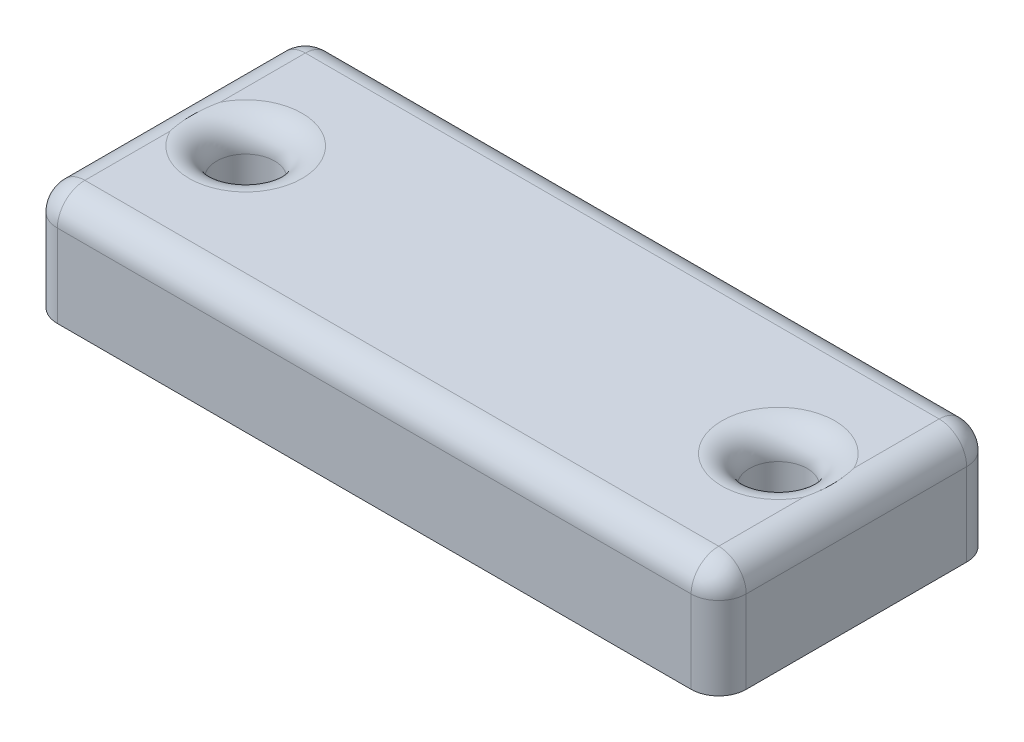
ISO-10303-21;
HEADER;
FILE_DESCRIPTION(('STEP AP214'),'2;1');
FILE_NAME('part.step','',(''),(''),'','','');
FILE_SCHEMA(('AUTOMOTIVE_DESIGN { 1 0 10303 214 1 1 1 1 }'));
ENDSEC;
DATA;
#1=APPLICATION_CONTEXT('core data for automotive mechanical design processes');
#2=APPLICATION_PROTOCOL_DEFINITION('international standard','automotive_design',2000,#1);
#3=PRODUCT_CONTEXT('',#1,'mechanical');
#4=PRODUCT('Part','Part','',(#3));
#5=PRODUCT_RELATED_PRODUCT_CATEGORY('part','',(#4));
#6=PRODUCT_DEFINITION_FORMATION('','',#4);
#7=PRODUCT_DEFINITION_CONTEXT('part definition',#1,'design');
#8=PRODUCT_DEFINITION('design','',#6,#7);
#9=PRODUCT_DEFINITION_SHAPE('','',#8);
#10=(LENGTH_UNIT() NAMED_UNIT(*) SI_UNIT(.MILLI.,.METRE.));
#11=(NAMED_UNIT(*) PLANE_ANGLE_UNIT() SI_UNIT($,.RADIAN.));
#12=(NAMED_UNIT(*) SI_UNIT($,.STERADIAN.) SOLID_ANGLE_UNIT());
#13=UNCERTAINTY_MEASURE_WITH_UNIT(LENGTH_MEASURE(1.E-05),#10,'distance_accuracy_value','');
#14=(GEOMETRIC_REPRESENTATION_CONTEXT(3) GLOBAL_UNCERTAINTY_ASSIGNED_CONTEXT((#13)) GLOBAL_UNIT_ASSIGNED_CONTEXT((#10,
#11,#12)) REPRESENTATION_CONTEXT('',''));
#15=CARTESIAN_POINT('',(0.,0.,0.));
#16=DIRECTION('',(0.,0.,1.));
#17=DIRECTION('',(1.,0.,0.));
#18=AXIS2_PLACEMENT_3D('',#15,#16,#17);
#19=CARTESIAN_POINT('',(0.,4.,0.));
#20=DIRECTION('',(0.,-1.,0.));
#21=DIRECTION('',(0.,0.,-1.));
#22=AXIS2_PLACEMENT_3D('',#19,#20,#21);
#23=PLANE('',#22);
#24=CARTESIAN_POINT('',(22.165015373627,4.,-5.00000000000001));
#25=DIRECTION('',(0.,-1.,0.));
#26=DIRECTION('',(0.,0.,-1.));
#27=AXIS2_PLACEMENT_3D('',#24,#25,#26);
#28=CIRCLE('',#27,2.05);
#29=CARTESIAN_POINT('',(22.165015373627,4.,-7.05000000000001));
#30=VERTEX_POINT('',#29);
#31=CARTESIAN_POINT('',(24.,4.,-5.91396467162284));
#32=VERTEX_POINT('',#31);
#33=EDGE_CURVE('E195',#30,#32,#28,.T.);
#34=ORIENTED_EDGE('',*,*,#33,.T.);
#35=DIRECTION('',(0.,0.,-1.));
#36=VECTOR('',#35,1.);
#37=CARTESIAN_POINT('',(24.,4.,0.));
#38=LINE('',#37,#36);
#39=CARTESIAN_POINT('',(24.,4.,-9.));
#40=VERTEX_POINT('',#39);
#41=EDGE_CURVE('E198',#32,#40,#38,.T.);
#42=ORIENTED_EDGE('',*,*,#41,.T.);
#43=DIRECTION('',(-1.,0.,0.));
#44=VECTOR('',#43,1.);
#45=CARTESIAN_POINT('',(0.,4.,-9.));
#46=LINE('',#45,#44);
#47=CARTESIAN_POINT('',(0.999999999999997,4.,-9.));
#48=VERTEX_POINT('',#47);
#49=EDGE_CURVE('E192',#40,#48,#46,.T.);
#50=ORIENTED_EDGE('',*,*,#49,.T.);
#51=DIRECTION('',(0.,0.,1.));
#52=VECTOR('',#51,1.);
#53=CARTESIAN_POINT('',(1.,4.,0.));
#54=LINE('',#53,#52);
#55=CARTESIAN_POINT('',(0.999999999999998,4.,-5.91396467162283));
#56=VERTEX_POINT('',#55);
#57=EDGE_CURVE('E189',#48,#56,#54,.T.);
#58=ORIENTED_EDGE('',*,*,#57,.T.);
#59=CARTESIAN_POINT('',(2.83498462637303,4.,-5.));
#60=DIRECTION('',(0.,-1.,0.));
#61=DIRECTION('',(0.,0.,-1.));
#62=AXIS2_PLACEMENT_3D('',#59,#60,#61);
#63=CIRCLE('',#62,2.05);
#64=CARTESIAN_POINT('',(2.83498462637303,4.,-2.95));
#65=VERTEX_POINT('',#64);
#66=EDGE_CURVE('E152',#56,#65,#63,.T.);
#67=ORIENTED_EDGE('',*,*,#66,.T.);
#68=CARTESIAN_POINT('',(2.83498462637303,4.,-5.));
#69=DIRECTION('',(0.,-1.,0.));
#70=DIRECTION('',(0.,0.,-1.));
#71=AXIS2_PLACEMENT_3D('',#68,#69,#70);
#72=CIRCLE('',#71,2.05);
#73=CARTESIAN_POINT('',(0.999999999999999,4.,-4.08603532837717));
#74=VERTEX_POINT('',#73);
#75=EDGE_CURVE('E146',#65,#74,#72,.T.);
#76=ORIENTED_EDGE('',*,*,#75,.T.);
#77=DIRECTION('',(0.,0.,1.));
#78=VECTOR('',#77,1.);
#79=CARTESIAN_POINT('',(1.,4.,0.));
#80=LINE('',#79,#78);
#81=CARTESIAN_POINT('',(1.,4.,-1.));
#82=VERTEX_POINT('',#81);
#83=EDGE_CURVE('E149',#74,#82,#80,.T.);
#84=ORIENTED_EDGE('',*,*,#83,.T.);
#85=DIRECTION('',(1.,0.,0.));
#86=VECTOR('',#85,1.);
#87=CARTESIAN_POINT('',(0.,4.,-1.));
#88=LINE('',#87,#86);
#89=CARTESIAN_POINT('',(24.,4.,-1.));
#90=VERTEX_POINT('',#89);
#91=EDGE_CURVE('E170',#82,#90,#88,.T.);
#92=ORIENTED_EDGE('',*,*,#91,.T.);
#93=DIRECTION('',(0.,0.,-1.));
#94=VECTOR('',#93,1.);
#95=CARTESIAN_POINT('',(24.,4.,0.));
#96=LINE('',#95,#94);
#97=CARTESIAN_POINT('',(24.,4.,-4.08603532837718));
#98=VERTEX_POINT('',#97);
#99=EDGE_CURVE('E155',#90,#98,#96,.T.);
#100=ORIENTED_EDGE('',*,*,#99,.T.);
#101=CARTESIAN_POINT('',(22.165015373627,4.,-5.00000000000001));
#102=DIRECTION('',(0.,-1.,0.));
#103=DIRECTION('',(0.,0.,-1.));
#104=AXIS2_PLACEMENT_3D('',#101,#102,#103);
#105=CIRCLE('',#104,2.05);
#106=EDGE_CURVE('E185',#98,#30,#105,.T.);
#107=ORIENTED_EDGE('',*,*,#106,.T.);
#108=EDGE_LOOP('',(#34,#42,#50,#58,#67,#76,#84,#92,#100,#107));
#109=FACE_BOUND('',#108,.T.);
#110=ADVANCED_FACE('F45',(#109),#23,.F.);
#111=CARTESIAN_POINT('',(0.,0.,0.));
#112=DIRECTION('',(0.,-1.,0.));
#113=DIRECTION('',(0.,0.,-1.));
#114=AXIS2_PLACEMENT_3D('',#111,#112,#113);
#115=PLANE('',#114);
#116=CARTESIAN_POINT('',(2.83498462637303,0.,-5.));
#117=DIRECTION('',(0.,1.,0.));
#118=DIRECTION('',(0.,0.,1.));
#119=AXIS2_PLACEMENT_3D('',#116,#117,#118);
#120=CIRCLE('',#119,1.05);
#121=CARTESIAN_POINT('',(2.83498462637303,0.,-3.95));
#122=VERTEX_POINT('',#121);
#123=EDGE_CURVE('E350',#122,#122,#120,.T.);
#124=ORIENTED_EDGE('',*,*,#123,.T.);
#125=EDGE_LOOP('',(#124));
#126=FACE_BOUND('',#125,.T.);
#127=DIRECTION('',(-1.,0.,0.));
#128=VECTOR('',#127,1.);
#129=CARTESIAN_POINT('',(0.,0.,-10.));
#130=LINE('',#129,#128);
#131=CARTESIAN_POINT('',(24.,0.,-10.));
#132=VERTEX_POINT('',#131);
#133=CARTESIAN_POINT('',(0.999999999999997,0.,-10.));
#134=VERTEX_POINT('',#133);
#135=EDGE_CURVE('E177',#132,#134,#130,.T.);
#136=ORIENTED_EDGE('',*,*,#135,.F.);
#137=CARTESIAN_POINT('',(24.,0.,-9.));
#138=DIRECTION('',(0.,-1.,0.));
#139=DIRECTION('',(0.,0.,-1.));
#140=AXIS2_PLACEMENT_3D('',#137,#138,#139);
#141=CIRCLE('',#140,1.);
#142=CARTESIAN_POINT('',(25.,0.,-9.));
#143=VERTEX_POINT('',#142);
#144=EDGE_CURVE('E11',#132,#143,#141,.T.);
#145=ORIENTED_EDGE('',*,*,#144,.T.);
#146=DIRECTION('',(0.,0.,-1.));
#147=VECTOR('',#146,1.);
#148=CARTESIAN_POINT('',(25.,0.,0.));
#149=LINE('',#148,#147);
#150=CARTESIAN_POINT('',(25.,0.,-1.));
#151=VERTEX_POINT('',#150);
#152=EDGE_CURVE('E390',#151,#143,#149,.T.);
#153=ORIENTED_EDGE('',*,*,#152,.F.);
#154=CARTESIAN_POINT('',(24.,0.,-1.));
#155=DIRECTION('',(0.,-1.,0.));
#156=DIRECTION('',(0.,0.,-1.));
#157=AXIS2_PLACEMENT_3D('',#154,#155,#156);
#158=CIRCLE('',#157,1.);
#159=CARTESIAN_POINT('',(24.,0.,0.));
#160=VERTEX_POINT('',#159);
#161=EDGE_CURVE('E61',#151,#160,#158,.T.);
#162=ORIENTED_EDGE('',*,*,#161,.T.);
#163=DIRECTION('',(1.,0.,0.));
#164=VECTOR('',#163,1.);
#165=CARTESIAN_POINT('',(0.,0.,0.));
#166=LINE('',#165,#164);
#167=CARTESIAN_POINT('',(1.,0.,0.));
#168=VERTEX_POINT('',#167);
#169=EDGE_CURVE('E349',#168,#160,#166,.T.);
#170=ORIENTED_EDGE('',*,*,#169,.F.);
#171=CARTESIAN_POINT('',(1.,0.,-1.));
#172=DIRECTION('',(0.,-1.,0.));
#173=DIRECTION('',(0.,0.,-1.));
#174=AXIS2_PLACEMENT_3D('',#171,#172,#173);
#175=CIRCLE('',#174,1.);
#176=CARTESIAN_POINT('',(0.,0.,-1.));
#177=VERTEX_POINT('',#176);
#178=EDGE_CURVE('E243',#168,#177,#175,.T.);
#179=ORIENTED_EDGE('',*,*,#178,.T.);
#180=DIRECTION('',(0.,0.,1.));
#181=VECTOR('',#180,1.);
#182=CARTESIAN_POINT('',(0.,0.,0.));
#183=LINE('',#182,#181);
#184=CARTESIAN_POINT('',(0.,0.,-9.));
#185=VERTEX_POINT('',#184);
#186=EDGE_CURVE('E345',#185,#177,#183,.T.);
#187=ORIENTED_EDGE('',*,*,#186,.F.);
#188=CARTESIAN_POINT('',(0.999999999999997,0.,-9.));
#189=DIRECTION('',(0.,-1.,0.));
#190=DIRECTION('',(0.,0.,-1.));
#191=AXIS2_PLACEMENT_3D('',#188,#189,#190);
#192=CIRCLE('',#191,1.);
#193=EDGE_CURVE('E240',#185,#134,#192,.T.);
#194=ORIENTED_EDGE('',*,*,#193,.T.);
#195=EDGE_LOOP('',(#136,#145,#153,#162,#170,#179,#187,#194));
#196=FACE_BOUND('',#195,.T.);
#197=CARTESIAN_POINT('',(22.165015373627,0.,-5.00000000000001));
#198=DIRECTION('',(0.,1.,0.));
#199=DIRECTION('',(0.,0.,-1.));
#200=AXIS2_PLACEMENT_3D('',#197,#198,#199);
#201=CIRCLE('',#200,1.05);
#202=CARTESIAN_POINT('',(22.165015373627,0.,-6.05000000000001));
#203=VERTEX_POINT('',#202);
#204=EDGE_CURVE('E162',#203,#203,#201,.T.);
#205=ORIENTED_EDGE('',*,*,#204,.T.);
#206=EDGE_LOOP('',(#205));
#207=FACE_BOUND('',#206,.T.);
#208=ADVANCED_FACE('F318',(#126,#196,#207),#115,.T.);
#209=CARTESIAN_POINT('',(0.,4.,0.));
#210=DIRECTION('',(1.,0.,0.));
#211=DIRECTION('',(0.,0.,-1.));
#212=AXIS2_PLACEMENT_3D('',#209,#210,#211);
#213=PLANE('',#212);
#214=ORIENTED_EDGE('',*,*,#186,.T.);
#215=DIRECTION('',(0.,-1.,0.));
#216=VECTOR('',#215,1.);
#217=CARTESIAN_POINT('',(0.,4.,-1.));
#218=LINE('',#217,#216);
#219=CARTESIAN_POINT('',(0.,3.,-1.));
#220=VERTEX_POINT('',#219);
#221=EDGE_CURVE('E69',#177,#220,#218,.F.);
#222=ORIENTED_EDGE('',*,*,#221,.T.);
#223=DIRECTION('',(0.,0.,1.));
#224=VECTOR('',#223,1.);
#225=CARTESIAN_POINT('',(0.,3.,0.));
#226=LINE('',#225,#224);
#227=CARTESIAN_POINT('',(0.,3.,-9.));
#228=VERTEX_POINT('',#227);
#229=EDGE_CURVE('E73',#220,#228,#226,.F.);
#230=ORIENTED_EDGE('',*,*,#229,.T.);
#231=DIRECTION('',(0.,-1.,0.));
#232=VECTOR('',#231,1.);
#233=CARTESIAN_POINT('',(0.,4.,-9.));
#234=LINE('',#233,#232);
#235=EDGE_CURVE('E233',#228,#185,#234,.T.);
#236=ORIENTED_EDGE('',*,*,#235,.T.);
#237=EDGE_LOOP('',(#214,#222,#230,#236));
#238=FACE_BOUND('',#237,.T.);
#239=ADVANCED_FACE('F323',(#238),#213,.F.);
#240=CARTESIAN_POINT('',(0.,4.,0.));
#241=DIRECTION('',(0.,0.,-1.));
#242=DIRECTION('',(-1.,0.,0.));
#243=AXIS2_PLACEMENT_3D('',#240,#241,#242);
#244=PLANE('',#243);
#245=ORIENTED_EDGE('',*,*,#169,.T.);
#246=DIRECTION('',(0.,-1.,0.));
#247=VECTOR('',#246,1.);
#248=CARTESIAN_POINT('',(24.,4.,0.));
#249=LINE('',#248,#247);
#250=CARTESIAN_POINT('',(24.,3.,0.));
#251=VERTEX_POINT('',#250);
#252=EDGE_CURVE('E230',#160,#251,#249,.F.);
#253=ORIENTED_EDGE('',*,*,#252,.T.);
#254=DIRECTION('',(1.,0.,0.));
#255=VECTOR('',#254,1.);
#256=CARTESIAN_POINT('',(0.,3.,0.));
#257=LINE('',#256,#255);
#258=CARTESIAN_POINT('',(1.,3.,0.));
#259=VERTEX_POINT('',#258);
#260=EDGE_CURVE('E227',#251,#259,#257,.F.);
#261=ORIENTED_EDGE('',*,*,#260,.T.);
#262=DIRECTION('',(0.,-1.,0.));
#263=VECTOR('',#262,1.);
#264=CARTESIAN_POINT('',(1.,4.,0.));
#265=LINE('',#264,#263);
#266=EDGE_CURVE('E224',#259,#168,#265,.T.);
#267=ORIENTED_EDGE('',*,*,#266,.T.);
#268=EDGE_LOOP('',(#245,#253,#261,#267));
#269=FACE_BOUND('',#268,.T.);
#270=ADVANCED_FACE('F337',(#269),#244,.F.);
#271=CARTESIAN_POINT('',(25.,4.,0.));
#272=DIRECTION('',(-1.,0.,0.));
#273=DIRECTION('',(0.,0.,1.));
#274=AXIS2_PLACEMENT_3D('',#271,#272,#273);
#275=PLANE('',#274);
#276=ORIENTED_EDGE('',*,*,#152,.T.);
#277=DIRECTION('',(0.,-1.,0.));
#278=VECTOR('',#277,1.);
#279=CARTESIAN_POINT('',(25.,4.,-9.));
#280=LINE('',#279,#278);
#281=CARTESIAN_POINT('',(25.,3.,-9.));
#282=VERTEX_POINT('',#281);
#283=EDGE_CURVE('E221',#143,#282,#280,.F.);
#284=ORIENTED_EDGE('',*,*,#283,.T.);
#285=DIRECTION('',(0.,0.,-1.));
#286=VECTOR('',#285,1.);
#287=CARTESIAN_POINT('',(25.,3.,0.));
#288=LINE('',#287,#286);
#289=CARTESIAN_POINT('',(25.,3.,-1.));
#290=VERTEX_POINT('',#289);
#291=EDGE_CURVE('E218',#282,#290,#288,.F.);
#292=ORIENTED_EDGE('',*,*,#291,.T.);
#293=DIRECTION('',(0.,-1.,0.));
#294=VECTOR('',#293,1.);
#295=CARTESIAN_POINT('',(25.,4.,-1.));
#296=LINE('',#295,#294);
#297=EDGE_CURVE('E215',#290,#151,#296,.T.);
#298=ORIENTED_EDGE('',*,*,#297,.T.);
#299=EDGE_LOOP('',(#276,#284,#292,#298));
#300=FACE_BOUND('',#299,.T.);
#301=ADVANCED_FACE('F333',(#300),#275,.F.);
#302=CARTESIAN_POINT('',(0.,4.,-10.));
#303=DIRECTION('',(0.,0.,1.));
#304=DIRECTION('',(1.,0.,0.));
#305=AXIS2_PLACEMENT_3D('',#302,#303,#304);
#306=PLANE('',#305);
#307=DIRECTION('',(-1.,0.,0.));
#308=VECTOR('',#307,1.);
#309=CARTESIAN_POINT('',(0.,3.,-10.));
#310=LINE('',#309,#308);
#311=CARTESIAN_POINT('',(0.999999999999997,3.,-10.));
#312=VERTEX_POINT('',#311);
#313=CARTESIAN_POINT('',(24.,3.,-10.));
#314=VERTEX_POINT('',#313);
#315=EDGE_CURVE('E208',#312,#314,#310,.F.);
#316=ORIENTED_EDGE('',*,*,#315,.T.);
#317=DIRECTION('',(0.,-1.,0.));
#318=VECTOR('',#317,1.);
#319=CARTESIAN_POINT('',(24.,4.,-10.));
#320=LINE('',#319,#318);
#321=EDGE_CURVE('E212',#314,#132,#320,.T.);
#322=ORIENTED_EDGE('',*,*,#321,.T.);
#323=ORIENTED_EDGE('',*,*,#135,.T.);
#324=DIRECTION('',(0.,-1.,0.));
#325=VECTOR('',#324,1.);
#326=CARTESIAN_POINT('',(0.999999999999997,4.,-10.));
#327=LINE('',#326,#325);
#328=EDGE_CURVE('E205',#134,#312,#327,.F.);
#329=ORIENTED_EDGE('',*,*,#328,.T.);
#330=EDGE_LOOP('',(#316,#322,#323,#329));
#331=FACE_BOUND('',#330,.T.);
#332=ADVANCED_FACE('F330',(#331),#306,.F.);
#333=CARTESIAN_POINT('',(2.83498462637303,4.,-5.));
#334=DIRECTION('',(0.,-1.,0.));
#335=DIRECTION('',(0.,0.,-1.));
#336=AXIS2_PLACEMENT_3D('',#333,#334,#335);
#337=CYLINDRICAL_SURFACE('',#336,1.05);
#338=CARTESIAN_POINT('',(2.83498462637303,3.,-5.));
#339=DIRECTION('',(0.,-1.,0.));
#340=DIRECTION('',(0.,0.,-1.));
#341=AXIS2_PLACEMENT_3D('',#338,#339,#340);
#342=CIRCLE('',#341,1.05);
#343=CARTESIAN_POINT('',(2.83498462637303,3.,-6.05));
#344=VERTEX_POINT('',#343);
#345=EDGE_CURVE('E201',#344,#344,#342,.F.);
#346=ORIENTED_EDGE('',*,*,#345,.T.);
#347=EDGE_LOOP('',(#346));
#348=FACE_BOUND('',#347,.T.);
#349=ORIENTED_EDGE('',*,*,#123,.F.);
#350=EDGE_LOOP('',(#349));
#351=FACE_BOUND('',#350,.T.);
#352=ADVANCED_FACE('F327',(#348,#351),#337,.F.);
#353=CARTESIAN_POINT('',(22.165015373627,4.,-5.00000000000001));
#354=DIRECTION('',(0.,-1.,0.));
#355=DIRECTION('',(0.,0.,-1.));
#356=AXIS2_PLACEMENT_3D('',#353,#354,#355);
#357=CYLINDRICAL_SURFACE('',#356,1.05);
#358=CARTESIAN_POINT('',(22.165015373627,3.,-5.00000000000001));
#359=DIRECTION('',(0.,-1.,0.));
#360=DIRECTION('',(0.,0.,-1.));
#361=AXIS2_PLACEMENT_3D('',#358,#359,#360);
#362=CIRCLE('',#361,1.05);
#363=CARTESIAN_POINT('',(22.165015373627,3.,-6.05000000000001));
#364=VERTEX_POINT('',#363);
#365=EDGE_CURVE('E171',#364,#364,#362,.F.);
#366=ORIENTED_EDGE('',*,*,#365,.T.);
#367=EDGE_LOOP('',(#366));
#368=FACE_BOUND('',#367,.T.);
#369=ORIENTED_EDGE('',*,*,#204,.F.);
#370=EDGE_LOOP('',(#369));
#371=FACE_BOUND('',#370,.T.);
#372=ADVANCED_FACE('F314',(#368,#371),#357,.F.);
#373=CARTESIAN_POINT('',(0.999999999999997,4.,-9.));
#374=DIRECTION('',(0.,-1.,0.));
#375=DIRECTION('',(0.,0.,-1.));
#376=AXIS2_PLACEMENT_3D('',#373,#374,#375);
#377=CYLINDRICAL_SURFACE('',#376,1.);
#378=ORIENTED_EDGE('',*,*,#193,.F.);
#379=ORIENTED_EDGE('',*,*,#235,.F.);
#380=CARTESIAN_POINT('',(0.999999999999997,3.,-9.));
#381=DIRECTION('',(0.,1.,0.));
#382=DIRECTION('',(0.,0.,1.));
#383=AXIS2_PLACEMENT_3D('',#380,#381,#382);
#384=CIRCLE('',#383,1.);
#385=EDGE_CURVE('E358',#312,#228,#384,.T.);
#386=ORIENTED_EDGE('',*,*,#385,.F.);
#387=ORIENTED_EDGE('',*,*,#328,.F.);
#388=EDGE_LOOP('',(#378,#379,#386,#387));
#389=FACE_BOUND('',#388,.T.);
#390=ADVANCED_FACE('F47',(#389),#377,.T.);
#391=CARTESIAN_POINT('',(1.,4.,-1.));
#392=DIRECTION('',(0.,-1.,0.));
#393=DIRECTION('',(0.,0.,-1.));
#394=AXIS2_PLACEMENT_3D('',#391,#392,#393);
#395=CYLINDRICAL_SURFACE('',#394,1.);
#396=ORIENTED_EDGE('',*,*,#178,.F.);
#397=ORIENTED_EDGE('',*,*,#266,.F.);
#398=CARTESIAN_POINT('',(1.,3.,-1.));
#399=DIRECTION('',(0.,1.,0.));
#400=DIRECTION('',(0.,0.,1.));
#401=AXIS2_PLACEMENT_3D('',#398,#399,#400);
#402=CIRCLE('',#401,1.);
#403=EDGE_CURVE('E355',#220,#259,#402,.T.);
#404=ORIENTED_EDGE('',*,*,#403,.F.);
#405=ORIENTED_EDGE('',*,*,#221,.F.);
#406=EDGE_LOOP('',(#396,#397,#404,#405));
#407=FACE_BOUND('',#406,.T.);
#408=ADVANCED_FACE('F304',(#407),#395,.T.);
#409=CARTESIAN_POINT('',(2.83498462637303,3.,-5.));
#410=DIRECTION('',(0.,-1.,0.));
#411=DIRECTION('',(0.,0.,-1.));
#412=AXIS2_PLACEMENT_3D('',#409,#410,#411);
#413=TOROIDAL_SURFACE('',#412,2.05,1.);
#414=ORIENTED_EDGE('',*,*,#345,.F.);
#415=EDGE_LOOP('',(#414));
#416=FACE_BOUND('',#415,.T.);
#417=ORIENTED_EDGE('',*,*,#75,.F.);
#418=ORIENTED_EDGE('',*,*,#66,.F.);
#419=CARTESIAN_POINT('',(0.999999999999998,4.,-5.91396467162283));
#420=CARTESIAN_POINT('',(0.999276958183459,3.99999998142386,-5.91089128043704));
#421=CARTESIAN_POINT('',(0.998557371192589,3.9999991982729,-5.90781703150536));
#422=CARTESIAN_POINT('',(0.972528815681455,3.99994364701559,-5.7960484141388));
#423=CARTESIAN_POINT('',(0.951541045892242,3.9989585538022,-5.6862941688104));
#424=CARTESIAN_POINT('',(0.918791592663721,3.99683361567689,-5.46535809287324));
#425=CARTESIAN_POINT('',(0.907036396840229,3.99569366260547,-5.35417531410986));
#426=CARTESIAN_POINT('',(0.893101866277063,3.99429510313502,-5.13109428914953));
#427=CARTESIAN_POINT('',(0.890931129344524,3.99403728811086,-5.01919549070142));
#428=CARTESIAN_POINT('',(0.896258619991004,3.99460843097824,-4.79568972690472));
#429=CARTESIAN_POINT('',(0.90375140241372,3.99543677684914,-4.68408263268451));
#430=CARTESIAN_POINT('',(0.924791388551907,3.99720427624262,-4.49261697645545));
#431=CARTESIAN_POINT('',(0.936095703224279,3.9980496855348,-4.41250082148965));
#432=CARTESIAN_POINT('',(0.96346211044083,3.99942656345618,-4.25316027805676));
#433=CARTESIAN_POINT('',(0.979518956227727,3.99995837636607,-4.17393500565838));
#434=CARTESIAN_POINT('',(0.998557371959325,3.99999920567544,-4.09218297983216));
#435=CARTESIAN_POINT('',(0.999276959048333,3.99999998907182,-4.08910873088435));
#436=CARTESIAN_POINT('',(0.999999999999999,4.,-4.08603532837717));
#437=B_SPLINE_CURVE_WITH_KNOTS('',3,(#419,#420,#421,#422,#423,#424,#425,#426,#427,#428,#429,
#430,#431,#432,#433,#434,#435,#436),.UNSPECIFIED.,.F.,.F.,(4,2,2,2,2,2,2,2,4),(0.,
0.00947201789232339,0.3442733737004,0.679309780329432,1.0146466727714,1.34979469362215,
1.59240573319963,1.83474992481014,1.84422194270793),.UNSPECIFIED.);
#438=EDGE_CURVE('E49',#74,#56,#437,.F.);
#439=ORIENTED_EDGE('',*,*,#438,.F.);
#440=EDGE_LOOP('',(#417,#418,#439));
#441=FACE_BOUND('',#440,.T.);
#442=ADVANCED_FACE('F158',(#416,#441),#413,.T.);
#443=CARTESIAN_POINT('',(1.,3.,0.));
#444=DIRECTION('',(0.,0.,1.));
#445=DIRECTION('',(1.,0.,0.));
#446=AXIS2_PLACEMENT_3D('',#443,#444,#445);
#447=CYLINDRICAL_SURFACE('',#446,1.);
#448=CARTESIAN_POINT('',(0.999999999999997,3.,-9.));
#449=DIRECTION('',(0.,0.,-1.));
#450=DIRECTION('',(-1.,0.,0.));
#451=AXIS2_PLACEMENT_3D('',#448,#449,#450);
#452=CIRCLE('',#451,1.);
#453=EDGE_CURVE('E163',#228,#48,#452,.T.);
#454=ORIENTED_EDGE('',*,*,#453,.F.);
#455=ORIENTED_EDGE('',*,*,#229,.F.);
#456=CARTESIAN_POINT('',(1.,3.,-1.));
#457=DIRECTION('',(0.,0.,1.));
#458=DIRECTION('',(1.,0.,0.));
#459=AXIS2_PLACEMENT_3D('',#456,#457,#458);
#460=CIRCLE('',#459,1.);
#461=EDGE_CURVE('E167',#82,#220,#460,.T.);
#462=ORIENTED_EDGE('',*,*,#461,.F.);
#463=ORIENTED_EDGE('',*,*,#83,.F.);
#464=ORIENTED_EDGE('',*,*,#438,.T.);
#465=ORIENTED_EDGE('',*,*,#57,.F.);
#466=EDGE_LOOP('',(#454,#455,#462,#463,#464,#465));
#467=FACE_BOUND('',#466,.T.);
#468=ADVANCED_FACE('F165',(#467),#447,.T.);
#469=CARTESIAN_POINT('',(0.999999999999997,3.,-9.));
#470=DIRECTION('',(-1.,0.,0.));
#471=DIRECTION('',(0.,0.,1.));
#472=AXIS2_PLACEMENT_3D('',#469,#470,#471);
#473=SPHERICAL_SURFACE('',#472,1.);
#474=ORIENTED_EDGE('',*,*,#385,.T.);
#475=ORIENTED_EDGE('',*,*,#453,.T.);
#476=CARTESIAN_POINT('',(0.999999999999997,3.,-9.));
#477=DIRECTION('',(-1.,0.,0.));
#478=DIRECTION('',(0.,0.,1.));
#479=AXIS2_PLACEMENT_3D('',#476,#477,#478);
#480=CIRCLE('',#479,1.);
#481=EDGE_CURVE('E363',#312,#48,#480,.F.);
#482=ORIENTED_EDGE('',*,*,#481,.F.);
#483=EDGE_LOOP('',(#474,#475,#482));
#484=FACE_BOUND('',#483,.T.);
#485=ADVANCED_FACE('F298',(#484),#473,.T.);
#486=CARTESIAN_POINT('',(1.,3.,-1.));
#487=DIRECTION('',(-1.,0.,0.));
#488=DIRECTION('',(0.,0.,1.));
#489=AXIS2_PLACEMENT_3D('',#486,#487,#488);
#490=SPHERICAL_SURFACE('',#489,1.);
#491=ORIENTED_EDGE('',*,*,#461,.T.);
#492=ORIENTED_EDGE('',*,*,#403,.T.);
#493=CARTESIAN_POINT('',(1.,3.,-1.));
#494=DIRECTION('',(-1.,0.,0.));
#495=DIRECTION('',(0.,0.,1.));
#496=AXIS2_PLACEMENT_3D('',#493,#494,#495);
#497=CIRCLE('',#496,1.);
#498=EDGE_CURVE('E360',#82,#259,#497,.F.);
#499=ORIENTED_EDGE('',*,*,#498,.F.);
#500=EDGE_LOOP('',(#491,#492,#499));
#501=FACE_BOUND('',#500,.T.);
#502=ADVANCED_FACE('F294',(#501),#490,.T.);
#503=CARTESIAN_POINT('',(0.,3.,-9.));
#504=DIRECTION('',(-1.,0.,0.));
#505=DIRECTION('',(0.,0.,1.));
#506=AXIS2_PLACEMENT_3D('',#503,#504,#505);
#507=CYLINDRICAL_SURFACE('',#506,1.);
#508=ORIENTED_EDGE('',*,*,#481,.T.);
#509=ORIENTED_EDGE('',*,*,#49,.F.);
#510=CARTESIAN_POINT('',(24.,3.,-9.));
#511=DIRECTION('',(1.,0.,0.));
#512=DIRECTION('',(0.,0.,-1.));
#513=AXIS2_PLACEMENT_3D('',#510,#511,#512);
#514=CIRCLE('',#513,1.);
#515=EDGE_CURVE('E380',#314,#40,#514,.T.);
#516=ORIENTED_EDGE('',*,*,#515,.F.);
#517=ORIENTED_EDGE('',*,*,#315,.F.);
#518=EDGE_LOOP('',(#508,#509,#516,#517));
#519=FACE_BOUND('',#518,.T.);
#520=ADVANCED_FACE('F290',(#519),#507,.T.);
#521=CARTESIAN_POINT('',(24.,4.,-9.));
#522=DIRECTION('',(0.,-1.,0.));
#523=DIRECTION('',(0.,0.,-1.));
#524=AXIS2_PLACEMENT_3D('',#521,#522,#523);
#525=CYLINDRICAL_SURFACE('',#524,1.);
#526=ORIENTED_EDGE('',*,*,#144,.F.);
#527=ORIENTED_EDGE('',*,*,#321,.F.);
#528=CARTESIAN_POINT('',(24.,3.,-9.));
#529=DIRECTION('',(0.,1.,0.));
#530=DIRECTION('',(0.,0.,1.));
#531=AXIS2_PLACEMENT_3D('',#528,#529,#530);
#532=CIRCLE('',#531,1.);
#533=EDGE_CURVE('E393',#282,#314,#532,.T.);
#534=ORIENTED_EDGE('',*,*,#533,.F.);
#535=ORIENTED_EDGE('',*,*,#283,.F.);
#536=EDGE_LOOP('',(#526,#527,#534,#535));
#537=FACE_BOUND('',#536,.T.);
#538=ADVANCED_FACE('F286',(#537),#525,.T.);
#539=CARTESIAN_POINT('',(24.,4.,-1.));
#540=DIRECTION('',(0.,-1.,0.));
#541=DIRECTION('',(0.,0.,-1.));
#542=AXIS2_PLACEMENT_3D('',#539,#540,#541);
#543=CYLINDRICAL_SURFACE('',#542,1.);
#544=ORIENTED_EDGE('',*,*,#161,.F.);
#545=ORIENTED_EDGE('',*,*,#297,.F.);
#546=CARTESIAN_POINT('',(24.,3.,-1.));
#547=DIRECTION('',(0.,1.,0.));
#548=DIRECTION('',(0.,0.,1.));
#549=AXIS2_PLACEMENT_3D('',#546,#547,#548);
#550=CIRCLE('',#549,1.);
#551=EDGE_CURVE('E551',#251,#290,#550,.T.);
#552=ORIENTED_EDGE('',*,*,#551,.F.);
#553=ORIENTED_EDGE('',*,*,#252,.F.);
#554=EDGE_LOOP('',(#544,#545,#552,#553));
#555=FACE_BOUND('',#554,.T.);
#556=ADVANCED_FACE('F282',(#555),#543,.T.);
#557=CARTESIAN_POINT('',(0.,3.,-1.));
#558=DIRECTION('',(1.,0.,0.));
#559=DIRECTION('',(0.,0.,-1.));
#560=AXIS2_PLACEMENT_3D('',#557,#558,#559);
#561=CYLINDRICAL_SURFACE('',#560,1.);
#562=ORIENTED_EDGE('',*,*,#498,.T.);
#563=ORIENTED_EDGE('',*,*,#260,.F.);
#564=CARTESIAN_POINT('',(24.,3.,-1.));
#565=DIRECTION('',(1.,0.,0.));
#566=DIRECTION('',(0.,0.,-1.));
#567=AXIS2_PLACEMENT_3D('',#564,#565,#566);
#568=CIRCLE('',#567,1.);
#569=EDGE_CURVE('E556',#90,#251,#568,.T.);
#570=ORIENTED_EDGE('',*,*,#569,.F.);
#571=ORIENTED_EDGE('',*,*,#91,.F.);
#572=EDGE_LOOP('',(#562,#563,#570,#571));
#573=FACE_BOUND('',#572,.T.);
#574=ADVANCED_FACE('F278',(#573),#561,.T.);
#575=CARTESIAN_POINT('',(24.,3.,-9.));
#576=DIRECTION('',(0.,0.,-1.));
#577=DIRECTION('',(-1.,0.,0.));
#578=AXIS2_PLACEMENT_3D('',#575,#576,#577);
#579=SPHERICAL_SURFACE('',#578,1.);
#580=ORIENTED_EDGE('',*,*,#533,.T.);
#581=ORIENTED_EDGE('',*,*,#515,.T.);
#582=CARTESIAN_POINT('',(24.,3.,-9.));
#583=DIRECTION('',(0.,0.,-1.));
#584=DIRECTION('',(-1.,0.,0.));
#585=AXIS2_PLACEMENT_3D('',#582,#583,#584);
#586=CIRCLE('',#585,1.);
#587=EDGE_CURVE('E561',#282,#40,#586,.F.);
#588=ORIENTED_EDGE('',*,*,#587,.F.);
#589=EDGE_LOOP('',(#580,#581,#588));
#590=FACE_BOUND('',#589,.T.);
#591=ADVANCED_FACE('F274',(#590),#579,.T.);
#592=CARTESIAN_POINT('',(24.,3.,-1.));
#593=DIRECTION('',(0.,0.,1.));
#594=DIRECTION('',(1.,0.,0.));
#595=AXIS2_PLACEMENT_3D('',#592,#593,#594);
#596=SPHERICAL_SURFACE('',#595,1.);
#597=ORIENTED_EDGE('',*,*,#569,.T.);
#598=ORIENTED_EDGE('',*,*,#551,.T.);
#599=CARTESIAN_POINT('',(24.,3.,-1.));
#600=DIRECTION('',(0.,0.,1.));
#601=DIRECTION('',(1.,0.,0.));
#602=AXIS2_PLACEMENT_3D('',#599,#600,#601);
#603=CIRCLE('',#602,1.);
#604=EDGE_CURVE('E258',#90,#290,#603,.F.);
#605=ORIENTED_EDGE('',*,*,#604,.F.);
#606=EDGE_LOOP('',(#597,#598,#605));
#607=FACE_BOUND('',#606,.T.);
#608=ADVANCED_FACE('F267',(#607),#596,.T.);
#609=CARTESIAN_POINT('',(24.,3.,0.));
#610=DIRECTION('',(0.,0.,-1.));
#611=DIRECTION('',(-1.,0.,0.));
#612=AXIS2_PLACEMENT_3D('',#609,#610,#611);
#613=CYLINDRICAL_SURFACE('',#612,1.);
#614=CARTESIAN_POINT('',(24.,4.00000000000006,-4.08603532837718));
#615=CARTESIAN_POINT('',(24.0007230418165,3.99999998142389,-4.08910871956297));
#616=CARTESIAN_POINT('',(24.0014426288074,3.99999919827292,-4.09218296849466));
#617=CARTESIAN_POINT('',(24.0274711843174,3.99994364701496,-4.20395158585915));
#618=CARTESIAN_POINT('',(24.0484589541067,3.99895855380207,-4.3137058311852));
#619=CARTESIAN_POINT('',(24.0812084073353,3.99683361567716,-4.53464190711771));
#620=CARTESIAN_POINT('',(24.0929636031587,3.99569366260562,-4.6458246858788));
#621=CARTESIAN_POINT('',(24.1068981337223,3.99429510313505,-4.86890571083448));
#622=CARTESIAN_POINT('',(24.1090688706553,3.99403728811087,-4.98080450928025));
#623=CARTESIAN_POINT('',(24.1037413800102,3.99460843097813,-5.20431027307236));
#624=CARTESIAN_POINT('',(24.0962485975883,3.99543677684891,-5.31591736729032));
#625=CARTESIAN_POINT('',(24.0752086114511,3.99720427624241,-5.50738302352179));
#626=CARTESIAN_POINT('',(24.0639042967784,3.9980496855347,-5.5874991784922));
#627=CARTESIAN_POINT('',(24.0365378895611,3.99942656345604,-5.74683972193427));
#628=CARTESIAN_POINT('',(24.0204810437737,3.99995837636577,-5.82606499433725));
#629=CARTESIAN_POINT('',(24.0014426280407,3.99999920567545,-5.90781702016784));
#630=CARTESIAN_POINT('',(24.0007230409517,3.99999998907184,-5.91089126911566));
#631=CARTESIAN_POINT('',(24.,4.00000000000004,-5.91396467162284));
#632=B_SPLINE_CURVE_WITH_KNOTS('',3,(#614,#615,#616,#617,#618,#619,#620,#621,#622,#623,#624,
#625,#626,#627,#628,#629,#630,#631),.UNSPECIFIED.,.F.,.F.,(4,2,2,2,2,2,2,2,4),(0.,
0.00947201789232396,0.344273373693615,0.679309780315748,1.01464667275076,1.34979469359462,
1.59240573318588,1.83474992481014,1.84422194270793),.UNSPECIFIED.);
#633=EDGE_CURVE('E248',#98,#32,#632,.T.);
#634=ORIENTED_EDGE('',*,*,#633,.F.);
#635=ORIENTED_EDGE('',*,*,#99,.F.);
#636=ORIENTED_EDGE('',*,*,#604,.T.);
#637=ORIENTED_EDGE('',*,*,#291,.F.);
#638=ORIENTED_EDGE('',*,*,#587,.T.);
#639=ORIENTED_EDGE('',*,*,#41,.F.);
#640=EDGE_LOOP('',(#634,#635,#636,#637,#638,#639));
#641=FACE_BOUND('',#640,.T.);
#642=ADVANCED_FACE('F262',(#641),#613,.T.);
#643=CARTESIAN_POINT('',(22.165015373627,3.,-5.00000000000001));
#644=DIRECTION('',(0.,-1.,0.));
#645=DIRECTION('',(0.,0.,-1.));
#646=AXIS2_PLACEMENT_3D('',#643,#644,#645);
#647=TOROIDAL_SURFACE('',#646,2.05,1.);
#648=ORIENTED_EDGE('',*,*,#106,.F.);
#649=ORIENTED_EDGE('',*,*,#633,.T.);
#650=ORIENTED_EDGE('',*,*,#33,.F.);
#651=EDGE_LOOP('',(#648,#649,#650));
#652=FACE_BOUND('',#651,.T.);
#653=ORIENTED_EDGE('',*,*,#365,.F.);
#654=EDGE_LOOP('',(#653));
#655=FACE_BOUND('',#654,.T.);
#656=ADVANCED_FACE('F266',(#652,#655),#647,.T.);
#657=CLOSED_SHELL('',(#110,#208,#239,#270,#301,#332,#352,#372,#390,#408,#442,#468,#485,#502,
#520,#538,#556,#574,#591,#608,#642,#656));
#658=MANIFOLD_SOLID_BREP('B2',#657);
#659=ADVANCED_BREP_SHAPE_REPRESENTATION('',(#18,#658),#14);
#660=SHAPE_DEFINITION_REPRESENTATION(#9,#659);
ENDSEC;
END-ISO-10303-21;
